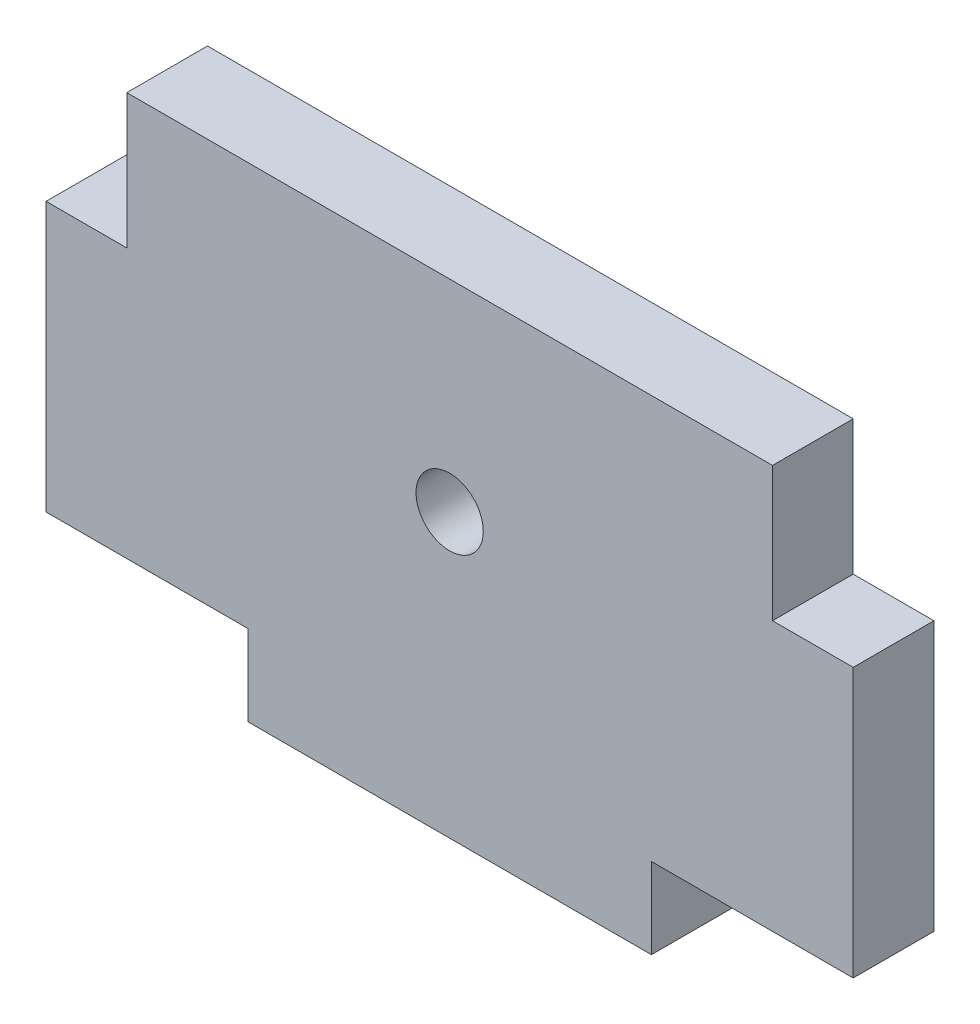
ISO-10303-21;
HEADER;
FILE_DESCRIPTION(('STEP AP214'),'2;1');
FILE_NAME('part.step','',(''),(''),'','','');
FILE_SCHEMA(('AUTOMOTIVE_DESIGN { 1 0 10303 214 1 1 1 1 }'));
ENDSEC;
DATA;
#1=APPLICATION_CONTEXT('core data for automotive mechanical design processes');
#2=APPLICATION_PROTOCOL_DEFINITION('international standard','automotive_design',2000,#1);
#3=PRODUCT_CONTEXT('',#1,'mechanical');
#4=PRODUCT('Part','Part','',(#3));
#5=PRODUCT_RELATED_PRODUCT_CATEGORY('part','',(#4));
#6=PRODUCT_DEFINITION_FORMATION('','',#4);
#7=PRODUCT_DEFINITION_CONTEXT('part definition',#1,'design');
#8=PRODUCT_DEFINITION('design','',#6,#7);
#9=PRODUCT_DEFINITION_SHAPE('','',#8);
#10=(LENGTH_UNIT() NAMED_UNIT(*) SI_UNIT(.MILLI.,.METRE.));
#11=(NAMED_UNIT(*) PLANE_ANGLE_UNIT() SI_UNIT($,.RADIAN.));
#12=(NAMED_UNIT(*) SI_UNIT($,.STERADIAN.) SOLID_ANGLE_UNIT());
#13=UNCERTAINTY_MEASURE_WITH_UNIT(LENGTH_MEASURE(1.E-05),#10,'distance_accuracy_value','');
#14=(GEOMETRIC_REPRESENTATION_CONTEXT(3) GLOBAL_UNCERTAINTY_ASSIGNED_CONTEXT((#13)) GLOBAL_UNIT_ASSIGNED_CONTEXT((#10,
#11,#12)) REPRESENTATION_CONTEXT('',''));
#15=CARTESIAN_POINT('',(0.,0.,0.));
#16=DIRECTION('',(0.,0.,1.));
#17=DIRECTION('',(1.,0.,0.));
#18=AXIS2_PLACEMENT_3D('',#15,#16,#17);
#19=CARTESIAN_POINT('',(0.,0.,6.));
#20=DIRECTION('',(1.,0.,0.));
#21=DIRECTION('',(0.,0.,-1.));
#22=AXIS2_PLACEMENT_3D('',#19,#20,#21);
#23=PLANE('',#22);
#24=DIRECTION('',(0.,-1.,0.));
#25=VECTOR('',#24,1.);
#26=CARTESIAN_POINT('',(0.,0.,6.));
#27=LINE('',#26,#25);
#28=CARTESIAN_POINT('',(0.,26.,6.));
#29=VERTEX_POINT('',#28);
#30=CARTESIAN_POINT('',(0.,6.,6.));
#31=VERTEX_POINT('',#30);
#32=EDGE_CURVE('E138',#29,#31,#27,.T.);
#33=ORIENTED_EDGE('',*,*,#32,.F.);
#34=DIRECTION('',(0.,0.,1.));
#35=VECTOR('',#34,1.);
#36=CARTESIAN_POINT('',(0.,26.,0.));
#37=LINE('',#36,#35);
#38=CARTESIAN_POINT('',(0.,26.,0.));
#39=VERTEX_POINT('',#38);
#40=EDGE_CURVE('E126',#39,#29,#37,.T.);
#41=ORIENTED_EDGE('',*,*,#40,.F.);
#42=DIRECTION('',(0.,-1.,0.));
#43=VECTOR('',#42,1.);
#44=CARTESIAN_POINT('',(0.,0.,0.));
#45=LINE('',#44,#43);
#46=CARTESIAN_POINT('',(0.,6.,0.));
#47=VERTEX_POINT('',#46);
#48=EDGE_CURVE('E136',#39,#47,#45,.T.);
#49=ORIENTED_EDGE('',*,*,#48,.T.);
#50=DIRECTION('',(0.,0.,1.));
#51=VECTOR('',#50,1.);
#52=CARTESIAN_POINT('',(0.,6.,0.));
#53=LINE('',#52,#51);
#54=EDGE_CURVE('E145',#47,#31,#53,.T.);
#55=ORIENTED_EDGE('',*,*,#54,.T.);
#56=EDGE_LOOP('',(#33,#41,#49,#55));
#57=FACE_BOUND('',#56,.T.);
#58=ADVANCED_FACE('F33',(#57),#23,.F.);
#59=CARTESIAN_POINT('',(0.,0.,6.));
#60=DIRECTION('',(0.,1.,0.));
#61=DIRECTION('',(0.,0.,1.));
#62=AXIS2_PLACEMENT_3D('',#59,#60,#61);
#63=PLANE('',#62);
#64=DIRECTION('',(1.,0.,0.));
#65=VECTOR('',#64,1.);
#66=CARTESIAN_POINT('',(0.,0.,6.));
#67=LINE('',#66,#65);
#68=CARTESIAN_POINT('',(15.,0.,6.));
#69=VERTEX_POINT('',#68);
#70=CARTESIAN_POINT('',(45.,0.,6.));
#71=VERTEX_POINT('',#70);
#72=EDGE_CURVE('E163',#69,#71,#67,.T.);
#73=ORIENTED_EDGE('',*,*,#72,.F.);
#74=DIRECTION('',(0.,0.,1.));
#75=VECTOR('',#74,1.);
#76=CARTESIAN_POINT('',(15.,0.,0.));
#77=LINE('',#76,#75);
#78=CARTESIAN_POINT('',(15.,0.,0.));
#79=VERTEX_POINT('',#78);
#80=EDGE_CURVE('E199',#79,#69,#77,.T.);
#81=ORIENTED_EDGE('',*,*,#80,.F.);
#82=DIRECTION('',(1.,0.,0.));
#83=VECTOR('',#82,1.);
#84=CARTESIAN_POINT('',(0.,0.,0.));
#85=LINE('',#84,#83);
#86=CARTESIAN_POINT('',(45.,0.,0.));
#87=VERTEX_POINT('',#86);
#88=EDGE_CURVE('E144',#79,#87,#85,.T.);
#89=ORIENTED_EDGE('',*,*,#88,.T.);
#90=DIRECTION('',(0.,0.,1.));
#91=VECTOR('',#90,1.);
#92=CARTESIAN_POINT('',(45.,0.,0.));
#93=LINE('',#92,#91);
#94=EDGE_CURVE('E203',#87,#71,#93,.T.);
#95=ORIENTED_EDGE('',*,*,#94,.T.);
#96=EDGE_LOOP('',(#73,#81,#89,#95));
#97=FACE_BOUND('',#96,.T.);
#98=ADVANCED_FACE('F262',(#97),#63,.F.);
#99=CARTESIAN_POINT('',(60.,0.,6.));
#100=DIRECTION('',(-1.,0.,0.));
#101=DIRECTION('',(0.,0.,1.));
#102=AXIS2_PLACEMENT_3D('',#99,#100,#101);
#103=PLANE('',#102);
#104=DIRECTION('',(0.,1.,0.));
#105=VECTOR('',#104,1.);
#106=CARTESIAN_POINT('',(60.,0.,0.));
#107=LINE('',#106,#105);
#108=CARTESIAN_POINT('',(60.,6.,0.));
#109=VERTEX_POINT('',#108);
#110=CARTESIAN_POINT('',(60.,26.,0.));
#111=VERTEX_POINT('',#110);
#112=EDGE_CURVE('E148',#109,#111,#107,.T.);
#113=ORIENTED_EDGE('',*,*,#112,.T.);
#114=DIRECTION('',(0.,0.,1.));
#115=VECTOR('',#114,1.);
#116=CARTESIAN_POINT('',(60.,26.,0.));
#117=LINE('',#116,#115);
#118=CARTESIAN_POINT('',(60.,26.,6.));
#119=VERTEX_POINT('',#118);
#120=EDGE_CURVE('E184',#111,#119,#117,.T.);
#121=ORIENTED_EDGE('',*,*,#120,.T.);
#122=DIRECTION('',(0.,1.,0.));
#123=VECTOR('',#122,1.);
#124=CARTESIAN_POINT('',(60.,0.,6.));
#125=LINE('',#124,#123);
#126=CARTESIAN_POINT('',(60.,6.,6.));
#127=VERTEX_POINT('',#126);
#128=EDGE_CURVE('E41',#127,#119,#125,.T.);
#129=ORIENTED_EDGE('',*,*,#128,.F.);
#130=DIRECTION('',(0.,0.,1.));
#131=VECTOR('',#130,1.);
#132=CARTESIAN_POINT('',(60.,6.,0.));
#133=LINE('',#132,#131);
#134=EDGE_CURVE('E171',#109,#127,#133,.T.);
#135=ORIENTED_EDGE('',*,*,#134,.F.);
#136=EDGE_LOOP('',(#113,#121,#129,#135));
#137=FACE_BOUND('',#136,.T.);
#138=ADVANCED_FACE('F183',(#137),#103,.F.);
#139=CARTESIAN_POINT('',(0.,36.,6.));
#140=DIRECTION('',(0.,-1.,0.));
#141=DIRECTION('',(0.,0.,-1.));
#142=AXIS2_PLACEMENT_3D('',#139,#140,#141);
#143=PLANE('',#142);
#144=DIRECTION('',(-1.,0.,0.));
#145=VECTOR('',#144,1.);
#146=CARTESIAN_POINT('',(0.,36.,0.));
#147=LINE('',#146,#145);
#148=CARTESIAN_POINT('',(54.,36.,0.));
#149=VERTEX_POINT('',#148);
#150=CARTESIAN_POINT('',(6.,36.,0.));
#151=VERTEX_POINT('',#150);
#152=EDGE_CURVE('E36',#149,#151,#147,.T.);
#153=ORIENTED_EDGE('',*,*,#152,.T.);
#154=DIRECTION('',(0.,0.,1.));
#155=VECTOR('',#154,1.);
#156=CARTESIAN_POINT('',(6.,36.,0.));
#157=LINE('',#156,#155);
#158=CARTESIAN_POINT('',(6.,36.,6.));
#159=VERTEX_POINT('',#158);
#160=EDGE_CURVE('E215',#151,#159,#157,.T.);
#161=ORIENTED_EDGE('',*,*,#160,.T.);
#162=DIRECTION('',(-1.,0.,0.));
#163=VECTOR('',#162,1.);
#164=CARTESIAN_POINT('',(0.,36.,6.));
#165=LINE('',#164,#163);
#166=CARTESIAN_POINT('',(54.,36.,6.));
#167=VERTEX_POINT('',#166);
#168=EDGE_CURVE('E11',#167,#159,#165,.T.);
#169=ORIENTED_EDGE('',*,*,#168,.F.);
#170=DIRECTION('',(0.,0.,1.));
#171=VECTOR('',#170,1.);
#172=CARTESIAN_POINT('',(54.,36.,0.));
#173=LINE('',#172,#171);
#174=EDGE_CURVE('E189',#149,#167,#173,.T.);
#175=ORIENTED_EDGE('',*,*,#174,.F.);
#176=EDGE_LOOP('',(#153,#161,#169,#175));
#177=FACE_BOUND('',#176,.T.);
#178=ADVANCED_FACE('F246',(#177),#143,.F.);
#179=CARTESIAN_POINT('',(0.,0.,6.));
#180=DIRECTION('',(0.,0.,-1.));
#181=DIRECTION('',(-1.,0.,0.));
#182=AXIS2_PLACEMENT_3D('',#179,#180,#181);
#183=PLANE('',#182);
#184=CARTESIAN_POINT('',(30.,21.,6.));
#185=DIRECTION('',(0.,0.,1.));
#186=DIRECTION('',(1.,0.,0.));
#187=AXIS2_PLACEMENT_3D('',#184,#185,#186);
#188=CIRCLE('',#187,2.50000000000001);
#189=CARTESIAN_POINT('',(32.5,21.,6.));
#190=VERTEX_POINT('',#189);
#191=EDGE_CURVE('E233',#190,#190,#188,.T.);
#192=ORIENTED_EDGE('',*,*,#191,.F.);
#193=EDGE_LOOP('',(#192));
#194=FACE_BOUND('',#193,.T.);
#195=ORIENTED_EDGE('',*,*,#168,.T.);
#196=DIRECTION('',(0.,1.,0.));
#197=VECTOR('',#196,1.);
#198=CARTESIAN_POINT('',(6.,36.,6.));
#199=LINE('',#198,#197);
#200=CARTESIAN_POINT('',(6.,26.,6.));
#201=VERTEX_POINT('',#200);
#202=EDGE_CURVE('E131',#201,#159,#199,.T.);
#203=ORIENTED_EDGE('',*,*,#202,.F.);
#204=DIRECTION('',(1.,0.,0.));
#205=VECTOR('',#204,1.);
#206=CARTESIAN_POINT('',(0.,26.,6.));
#207=LINE('',#206,#205);
#208=EDGE_CURVE('E185',#29,#201,#207,.T.);
#209=ORIENTED_EDGE('',*,*,#208,.F.);
#210=ORIENTED_EDGE('',*,*,#32,.T.);
#211=DIRECTION('',(-1.,0.,0.));
#212=VECTOR('',#211,1.);
#213=CARTESIAN_POINT('',(0.,6.,6.));
#214=LINE('',#213,#212);
#215=CARTESIAN_POINT('',(15.,6.,6.));
#216=VERTEX_POINT('',#215);
#217=EDGE_CURVE('E197',#216,#31,#214,.T.);
#218=ORIENTED_EDGE('',*,*,#217,.F.);
#219=DIRECTION('',(0.,1.,0.));
#220=VECTOR('',#219,1.);
#221=CARTESIAN_POINT('',(15.,0.,6.));
#222=LINE('',#221,#220);
#223=EDGE_CURVE('E200',#69,#216,#222,.T.);
#224=ORIENTED_EDGE('',*,*,#223,.F.);
#225=ORIENTED_EDGE('',*,*,#72,.T.);
#226=DIRECTION('',(0.,-1.,0.));
#227=VECTOR('',#226,1.);
#228=CARTESIAN_POINT('',(45.,0.,6.));
#229=LINE('',#228,#227);
#230=CARTESIAN_POINT('',(45.,6.,6.));
#231=VERTEX_POINT('',#230);
#232=EDGE_CURVE('E211',#231,#71,#229,.T.);
#233=ORIENTED_EDGE('',*,*,#232,.F.);
#234=DIRECTION('',(-1.,0.,0.));
#235=VECTOR('',#234,1.);
#236=CARTESIAN_POINT('',(60.,6.,6.));
#237=LINE('',#236,#235);
#238=EDGE_CURVE('E182',#127,#231,#237,.T.);
#239=ORIENTED_EDGE('',*,*,#238,.F.);
#240=ORIENTED_EDGE('',*,*,#128,.T.);
#241=DIRECTION('',(1.,0.,0.));
#242=VECTOR('',#241,1.);
#243=CARTESIAN_POINT('',(60.,26.,6.));
#244=LINE('',#243,#242);
#245=CARTESIAN_POINT('',(54.,26.,6.));
#246=VERTEX_POINT('',#245);
#247=EDGE_CURVE('E179',#246,#119,#244,.T.);
#248=ORIENTED_EDGE('',*,*,#247,.F.);
#249=DIRECTION('',(0.,-1.,0.));
#250=VECTOR('',#249,1.);
#251=CARTESIAN_POINT('',(54.,36.,6.));
#252=LINE('',#251,#250);
#253=EDGE_CURVE('E228',#167,#246,#252,.T.);
#254=ORIENTED_EDGE('',*,*,#253,.F.);
#255=EDGE_LOOP('',(#195,#203,#209,#210,#218,#224,#225,#233,#239,#240,#248,#254));
#256=FACE_BOUND('',#255,.T.);
#257=ADVANCED_FACE('F177',(#194,#256),#183,.F.);
#258=CARTESIAN_POINT('',(0.,0.,0.));
#259=DIRECTION('',(0.,0.,-1.));
#260=DIRECTION('',(-1.,0.,0.));
#261=AXIS2_PLACEMENT_3D('',#258,#259,#260);
#262=PLANE('',#261);
#263=CARTESIAN_POINT('',(30.,21.,0.));
#264=DIRECTION('',(0.,0.,1.));
#265=DIRECTION('',(1.,0.,0.));
#266=AXIS2_PLACEMENT_3D('',#263,#264,#265);
#267=CIRCLE('',#266,2.50000000000001);
#268=CARTESIAN_POINT('',(32.5,21.,0.));
#269=VERTEX_POINT('',#268);
#270=EDGE_CURVE('E230',#269,#269,#267,.T.);
#271=ORIENTED_EDGE('',*,*,#270,.T.);
#272=EDGE_LOOP('',(#271));
#273=FACE_BOUND('',#272,.T.);
#274=DIRECTION('',(0.,1.,0.));
#275=VECTOR('',#274,1.);
#276=CARTESIAN_POINT('',(6.,36.,0.));
#277=LINE('',#276,#275);
#278=CARTESIAN_POINT('',(6.,26.,0.));
#279=VERTEX_POINT('',#278);
#280=EDGE_CURVE('E49',#279,#151,#277,.T.);
#281=ORIENTED_EDGE('',*,*,#280,.T.);
#282=ORIENTED_EDGE('',*,*,#152,.F.);
#283=DIRECTION('',(0.,-1.,0.));
#284=VECTOR('',#283,1.);
#285=CARTESIAN_POINT('',(54.,36.,0.));
#286=LINE('',#285,#284);
#287=CARTESIAN_POINT('',(54.,26.,0.));
#288=VERTEX_POINT('',#287);
#289=EDGE_CURVE('E225',#149,#288,#286,.T.);
#290=ORIENTED_EDGE('',*,*,#289,.T.);
#291=DIRECTION('',(1.,0.,0.));
#292=VECTOR('',#291,1.);
#293=CARTESIAN_POINT('',(60.,26.,0.));
#294=LINE('',#293,#292);
#295=EDGE_CURVE('E57',#288,#111,#294,.T.);
#296=ORIENTED_EDGE('',*,*,#295,.T.);
#297=ORIENTED_EDGE('',*,*,#112,.F.);
#298=DIRECTION('',(-1.,0.,0.));
#299=VECTOR('',#298,1.);
#300=CARTESIAN_POINT('',(60.,6.,0.));
#301=LINE('',#300,#299);
#302=CARTESIAN_POINT('',(45.,6.,0.));
#303=VERTEX_POINT('',#302);
#304=EDGE_CURVE('E207',#109,#303,#301,.T.);
#305=ORIENTED_EDGE('',*,*,#304,.T.);
#306=DIRECTION('',(0.,-1.,0.));
#307=VECTOR('',#306,1.);
#308=CARTESIAN_POINT('',(45.,0.,0.));
#309=LINE('',#308,#307);
#310=EDGE_CURVE('E210',#303,#87,#309,.T.);
#311=ORIENTED_EDGE('',*,*,#310,.T.);
#312=ORIENTED_EDGE('',*,*,#88,.F.);
#313=DIRECTION('',(0.,1.,0.));
#314=VECTOR('',#313,1.);
#315=CARTESIAN_POINT('',(15.,0.,0.));
#316=LINE('',#315,#314);
#317=CARTESIAN_POINT('',(15.,6.,0.));
#318=VERTEX_POINT('',#317);
#319=EDGE_CURVE('E195',#79,#318,#316,.T.);
#320=ORIENTED_EDGE('',*,*,#319,.T.);
#321=DIRECTION('',(-1.,0.,0.));
#322=VECTOR('',#321,1.);
#323=CARTESIAN_POINT('',(0.,6.,0.));
#324=LINE('',#323,#322);
#325=EDGE_CURVE('E143',#318,#47,#324,.T.);
#326=ORIENTED_EDGE('',*,*,#325,.T.);
#327=ORIENTED_EDGE('',*,*,#48,.F.);
#328=DIRECTION('',(1.,0.,0.));
#329=VECTOR('',#328,1.);
#330=CARTESIAN_POINT('',(0.,26.,0.));
#331=LINE('',#330,#329);
#332=EDGE_CURVE('E122',#39,#279,#331,.T.);
#333=ORIENTED_EDGE('',*,*,#332,.T.);
#334=EDGE_LOOP('',(#281,#282,#290,#296,#297,#305,#311,#312,#320,#326,#327,#333));
#335=FACE_BOUND('',#334,.T.);
#336=ADVANCED_FACE('F141',(#273,#335),#262,.T.);
#337=CARTESIAN_POINT('',(45.,0.,0.));
#338=DIRECTION('',(-1.,0.,0.));
#339=DIRECTION('',(0.,0.,1.));
#340=AXIS2_PLACEMENT_3D('',#337,#338,#339);
#341=PLANE('',#340);
#342=ORIENTED_EDGE('',*,*,#232,.T.);
#343=ORIENTED_EDGE('',*,*,#94,.F.);
#344=ORIENTED_EDGE('',*,*,#310,.F.);
#345=DIRECTION('',(0.,0.,1.));
#346=VECTOR('',#345,1.);
#347=CARTESIAN_POINT('',(45.,6.,0.));
#348=LINE('',#347,#346);
#349=EDGE_CURVE('E218',#303,#231,#348,.T.);
#350=ORIENTED_EDGE('',*,*,#349,.T.);
#351=EDGE_LOOP('',(#342,#343,#344,#350));
#352=FACE_BOUND('',#351,.T.);
#353=ADVANCED_FACE('F277',(#352),#341,.F.);
#354=CARTESIAN_POINT('',(60.,6.,0.));
#355=DIRECTION('',(0.,1.,0.));
#356=DIRECTION('',(-1.,0.,0.));
#357=AXIS2_PLACEMENT_3D('',#354,#355,#356);
#358=PLANE('',#357);
#359=ORIENTED_EDGE('',*,*,#238,.T.);
#360=ORIENTED_EDGE('',*,*,#349,.F.);
#361=ORIENTED_EDGE('',*,*,#304,.F.);
#362=ORIENTED_EDGE('',*,*,#134,.T.);
#363=EDGE_LOOP('',(#359,#360,#361,#362));
#364=FACE_BOUND('',#363,.T.);
#365=ADVANCED_FACE('F222',(#364),#358,.F.);
#366=CARTESIAN_POINT('',(0.,6.,0.));
#367=DIRECTION('',(0.,1.,0.));
#368=DIRECTION('',(0.,0.,1.));
#369=AXIS2_PLACEMENT_3D('',#366,#367,#368);
#370=PLANE('',#369);
#371=ORIENTED_EDGE('',*,*,#217,.T.);
#372=ORIENTED_EDGE('',*,*,#54,.F.);
#373=ORIENTED_EDGE('',*,*,#325,.F.);
#374=DIRECTION('',(0.,0.,1.));
#375=VECTOR('',#374,1.);
#376=CARTESIAN_POINT('',(15.,6.,0.));
#377=LINE('',#376,#375);
#378=EDGE_CURVE('E150',#318,#216,#377,.T.);
#379=ORIENTED_EDGE('',*,*,#378,.T.);
#380=EDGE_LOOP('',(#371,#372,#373,#379));
#381=FACE_BOUND('',#380,.T.);
#382=ADVANCED_FACE('F257',(#381),#370,.F.);
#383=CARTESIAN_POINT('',(15.,0.,0.));
#384=DIRECTION('',(1.,0.,0.));
#385=DIRECTION('',(0.,1.,0.));
#386=AXIS2_PLACEMENT_3D('',#383,#384,#385);
#387=PLANE('',#386);
#388=ORIENTED_EDGE('',*,*,#223,.T.);
#389=ORIENTED_EDGE('',*,*,#378,.F.);
#390=ORIENTED_EDGE('',*,*,#319,.F.);
#391=ORIENTED_EDGE('',*,*,#80,.T.);
#392=EDGE_LOOP('',(#388,#389,#390,#391));
#393=FACE_BOUND('',#392,.T.);
#394=ADVANCED_FACE('F250',(#393),#387,.F.);
#395=CARTESIAN_POINT('',(60.,26.,0.));
#396=DIRECTION('',(0.,-1.,0.));
#397=DIRECTION('',(0.,0.,-1.));
#398=AXIS2_PLACEMENT_3D('',#395,#396,#397);
#399=PLANE('',#398);
#400=ORIENTED_EDGE('',*,*,#247,.T.);
#401=ORIENTED_EDGE('',*,*,#120,.F.);
#402=ORIENTED_EDGE('',*,*,#295,.F.);
#403=DIRECTION('',(0.,0.,1.));
#404=VECTOR('',#403,1.);
#405=CARTESIAN_POINT('',(54.,26.,0.));
#406=LINE('',#405,#404);
#407=EDGE_CURVE('E186',#288,#246,#406,.T.);
#408=ORIENTED_EDGE('',*,*,#407,.T.);
#409=EDGE_LOOP('',(#400,#401,#402,#408));
#410=FACE_BOUND('',#409,.T.);
#411=ADVANCED_FACE('F248',(#410),#399,.F.);
#412=CARTESIAN_POINT('',(54.,36.,0.));
#413=DIRECTION('',(-1.,0.,0.));
#414=DIRECTION('',(0.,-1.,0.));
#415=AXIS2_PLACEMENT_3D('',#412,#413,#414);
#416=PLANE('',#415);
#417=ORIENTED_EDGE('',*,*,#253,.T.);
#418=ORIENTED_EDGE('',*,*,#407,.F.);
#419=ORIENTED_EDGE('',*,*,#289,.F.);
#420=ORIENTED_EDGE('',*,*,#174,.T.);
#421=EDGE_LOOP('',(#417,#418,#419,#420));
#422=FACE_BOUND('',#421,.T.);
#423=ADVANCED_FACE('F247',(#422),#416,.F.);
#424=CARTESIAN_POINT('',(6.,36.,0.));
#425=DIRECTION('',(1.,0.,0.));
#426=DIRECTION('',(0.,1.,0.));
#427=AXIS2_PLACEMENT_3D('',#424,#425,#426);
#428=PLANE('',#427);
#429=ORIENTED_EDGE('',*,*,#202,.T.);
#430=ORIENTED_EDGE('',*,*,#160,.F.);
#431=ORIENTED_EDGE('',*,*,#280,.F.);
#432=DIRECTION('',(0.,0.,1.));
#433=VECTOR('',#432,1.);
#434=CARTESIAN_POINT('',(6.,26.,0.));
#435=LINE('',#434,#433);
#436=EDGE_CURVE('E128',#279,#201,#435,.T.);
#437=ORIENTED_EDGE('',*,*,#436,.T.);
#438=EDGE_LOOP('',(#429,#430,#431,#437));
#439=FACE_BOUND('',#438,.T.);
#440=ADVANCED_FACE('F243',(#439),#428,.F.);
#441=CARTESIAN_POINT('',(0.,26.,0.));
#442=DIRECTION('',(0.,-1.,0.));
#443=DIRECTION('',(0.,0.,-1.));
#444=AXIS2_PLACEMENT_3D('',#441,#442,#443);
#445=PLANE('',#444);
#446=ORIENTED_EDGE('',*,*,#208,.T.);
#447=ORIENTED_EDGE('',*,*,#436,.F.);
#448=ORIENTED_EDGE('',*,*,#332,.F.);
#449=ORIENTED_EDGE('',*,*,#40,.T.);
#450=EDGE_LOOP('',(#446,#447,#448,#449));
#451=FACE_BOUND('',#450,.T.);
#452=ADVANCED_FACE('F125',(#451),#445,.F.);
#453=CARTESIAN_POINT('',(30.,21.,0.));
#454=DIRECTION('',(0.,0.,1.));
#455=DIRECTION('',(1.,0.,0.));
#456=AXIS2_PLACEMENT_3D('',#453,#454,#455);
#457=CYLINDRICAL_SURFACE('',#456,2.50000000000001);
#458=ORIENTED_EDGE('',*,*,#270,.F.);
#459=EDGE_LOOP('',(#458));
#460=FACE_BOUND('',#459,.T.);
#461=ORIENTED_EDGE('',*,*,#191,.T.);
#462=EDGE_LOOP('',(#461));
#463=FACE_BOUND('',#462,.T.);
#464=ADVANCED_FACE('F343',(#460,#463),#457,.F.);
#465=CLOSED_SHELL('',(#58,#98,#138,#178,#257,#336,#353,#365,#382,#394,#411,#423,#440,#452,#464));
#466=MANIFOLD_SOLID_BREP('B2',#465);
#467=ADVANCED_BREP_SHAPE_REPRESENTATION('',(#18,#466),#14);
#468=SHAPE_DEFINITION_REPRESENTATION(#9,#467);
ENDSEC;
END-ISO-10303-21;
